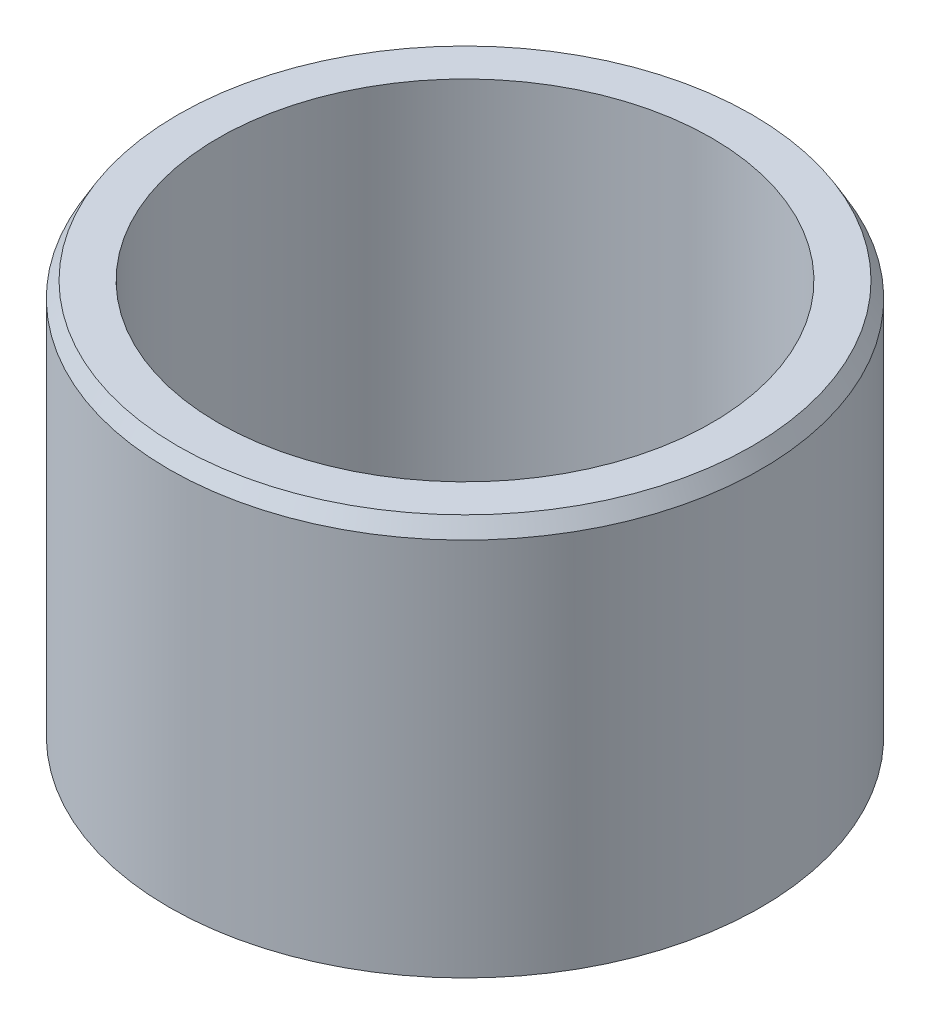
ISO-10303-21;
HEADER;
FILE_DESCRIPTION(('STEP AP214'),'2;1');
FILE_NAME('part.step','',(''),(''),'','','');
FILE_SCHEMA(('AUTOMOTIVE_DESIGN { 1 0 10303 214 1 1 1 1 }'));
ENDSEC;
DATA;
#1=APPLICATION_CONTEXT('core data for automotive mechanical design processes');
#2=APPLICATION_PROTOCOL_DEFINITION('international standard','automotive_design',2000,#1);
#3=PRODUCT_CONTEXT('',#1,'mechanical');
#4=PRODUCT('Part','Part','',(#3));
#5=PRODUCT_RELATED_PRODUCT_CATEGORY('part','',(#4));
#6=PRODUCT_DEFINITION_FORMATION('','',#4);
#7=PRODUCT_DEFINITION_CONTEXT('part definition',#1,'design');
#8=PRODUCT_DEFINITION('design','',#6,#7);
#9=PRODUCT_DEFINITION_SHAPE('','',#8);
#10=(LENGTH_UNIT() NAMED_UNIT(*) SI_UNIT(.MILLI.,.METRE.));
#11=(NAMED_UNIT(*) PLANE_ANGLE_UNIT() SI_UNIT($,.RADIAN.));
#12=(NAMED_UNIT(*) SI_UNIT($,.STERADIAN.) SOLID_ANGLE_UNIT());
#13=UNCERTAINTY_MEASURE_WITH_UNIT(LENGTH_MEASURE(1.E-05),#10,'distance_accuracy_value','');
#14=(GEOMETRIC_REPRESENTATION_CONTEXT(3) GLOBAL_UNCERTAINTY_ASSIGNED_CONTEXT((#13)) GLOBAL_UNIT_ASSIGNED_CONTEXT((#10,
#11,#12)) REPRESENTATION_CONTEXT('',''));
#15=CARTESIAN_POINT('',(0.,0.,0.));
#16=DIRECTION('',(0.,0.,1.));
#17=DIRECTION('',(1.,0.,0.));
#18=AXIS2_PLACEMENT_3D('',#15,#16,#17);
#19=CARTESIAN_POINT('',(0.,21.4398777173913,0.));
#20=DIRECTION('',(0.,1.,0.));
#21=DIRECTION('',(0.,0.,1.));
#22=AXIS2_PLACEMENT_3D('',#19,#20,#21);
#23=CYLINDRICAL_SURFACE('',#22,7.9375);
#24=CARTESIAN_POINT('',(0.,0.,0.));
#25=DIRECTION('',(0.,1.,0.));
#26=DIRECTION('',(0.,0.,1.));
#27=AXIS2_PLACEMENT_3D('',#24,#25,#26);
#28=CIRCLE('',#27,7.9375);
#29=CARTESIAN_POINT('',(0.,0.,7.9375));
#30=VERTEX_POINT('',#29);
#31=EDGE_CURVE('E41',#30,#30,#28,.T.);
#32=ORIENTED_EDGE('',*,*,#31,.F.);
#33=EDGE_LOOP('',(#32));
#34=FACE_BOUND('',#33,.T.);
#35=CARTESIAN_POINT('',(0.,12.7,0.));
#36=DIRECTION('',(0.,1.,0.));
#37=DIRECTION('',(0.,0.,1.));
#38=AXIS2_PLACEMENT_3D('',#35,#36,#37);
#39=CIRCLE('',#38,7.9375);
#40=CARTESIAN_POINT('',(0.,12.7,7.9375));
#41=VERTEX_POINT('',#40);
#42=EDGE_CURVE('E50',#41,#41,#39,.T.);
#43=ORIENTED_EDGE('',*,*,#42,.T.);
#44=EDGE_LOOP('',(#43));
#45=FACE_BOUND('',#44,.T.);
#46=ADVANCED_FACE('F30',(#34,#45),#23,.F.);
#47=CARTESIAN_POINT('',(7.9375,0.,0.));
#48=DIRECTION('',(0.,1.,0.));
#49=DIRECTION('',(0.,0.,1.));
#50=AXIS2_PLACEMENT_3D('',#47,#48,#49);
#51=PLANE('',#50);
#52=CARTESIAN_POINT('',(0.,0.,0.));
#53=DIRECTION('',(0.,1.,0.));
#54=DIRECTION('',(0.,0.,1.));
#55=AXIS2_PLACEMENT_3D('',#52,#53,#54);
#56=CIRCLE('',#55,9.525);
#57=CARTESIAN_POINT('',(0.,0.,9.525));
#58=VERTEX_POINT('',#57);
#59=EDGE_CURVE('E45',#58,#58,#56,.T.);
#60=ORIENTED_EDGE('',*,*,#59,.F.);
#61=EDGE_LOOP('',(#60));
#62=FACE_BOUND('',#61,.T.);
#63=ORIENTED_EDGE('',*,*,#31,.T.);
#64=EDGE_LOOP('',(#63));
#65=FACE_BOUND('',#64,.T.);
#66=ADVANCED_FACE('F64',(#62,#65),#51,.F.);
#67=CARTESIAN_POINT('',(0.,21.4398777173913,0.));
#68=DIRECTION('',(0.,1.,0.));
#69=DIRECTION('',(0.,0.,1.));
#70=AXIS2_PLACEMENT_3D('',#67,#68,#69);
#71=CYLINDRICAL_SURFACE('',#70,9.525);
#72=CARTESIAN_POINT('',(0.,12.19962,0.));
#73=DIRECTION('',(0.,-1.,0.));
#74=DIRECTION('',(0.,0.,-1.));
#75=AXIS2_PLACEMENT_3D('',#72,#73,#74);
#76=CIRCLE('',#75,9.525);
#77=CARTESIAN_POINT('',(0.,12.19962,-9.525));
#78=VERTEX_POINT('',#77);
#79=EDGE_CURVE('E10',#78,#78,#76,.T.);
#80=ORIENTED_EDGE('',*,*,#79,.T.);
#81=EDGE_LOOP('',(#80));
#82=FACE_BOUND('',#81,.T.);
#83=ORIENTED_EDGE('',*,*,#59,.T.);
#84=EDGE_LOOP('',(#83));
#85=FACE_BOUND('',#84,.T.);
#86=ADVANCED_FACE('F57',(#82,#85),#71,.T.);
#87=CARTESIAN_POINT('',(7.9375,12.7,0.));
#88=DIRECTION('',(0.,-1.,0.));
#89=DIRECTION('',(0.,0.,-1.));
#90=AXIS2_PLACEMENT_3D('',#87,#88,#89);
#91=PLANE('',#90);
#92=CARTESIAN_POINT('',(0.,12.7,0.));
#93=DIRECTION('',(0.,-1.,0.));
#94=DIRECTION('',(0.,0.,-1.));
#95=AXIS2_PLACEMENT_3D('',#92,#93,#94);
#96=CIRCLE('',#95,9.23610547230289);
#97=CARTESIAN_POINT('',(0.,12.7,-9.23610547230289));
#98=VERTEX_POINT('',#97);
#99=EDGE_CURVE('E37',#98,#98,#96,.F.);
#100=ORIENTED_EDGE('',*,*,#99,.T.);
#101=EDGE_LOOP('',(#100));
#102=FACE_BOUND('',#101,.T.);
#103=ORIENTED_EDGE('',*,*,#42,.F.);
#104=EDGE_LOOP('',(#103));
#105=FACE_BOUND('',#104,.T.);
#106=ADVANCED_FACE('F55',(#102,#105),#91,.F.);
#107=CARTESIAN_POINT('',(0.,12.7,0.));
#108=DIRECTION('',(0.,-1.,0.));
#109=DIRECTION('',(0.,0.,-1.));
#110=AXIS2_PLACEMENT_3D('',#107,#108,#109);
#111=CONICAL_SURFACE('',#110,9.23610547230289,0.523598775598297);
#112=ORIENTED_EDGE('',*,*,#79,.F.);
#113=EDGE_LOOP('',(#112));
#114=FACE_BOUND('',#113,.T.);
#115=ORIENTED_EDGE('',*,*,#99,.F.);
#116=EDGE_LOOP('',(#115));
#117=FACE_BOUND('',#116,.T.);
#118=ADVANCED_FACE('F32',(#114,#117),#111,.T.);
#119=CLOSED_SHELL('',(#46,#66,#86,#106,#118));
#120=MANIFOLD_SOLID_BREP('B2',#119);
#121=ADVANCED_BREP_SHAPE_REPRESENTATION('',(#18,#120),#14);
#122=SHAPE_DEFINITION_REPRESENTATION(#9,#121);
ENDSEC;
END-ISO-10303-21;
